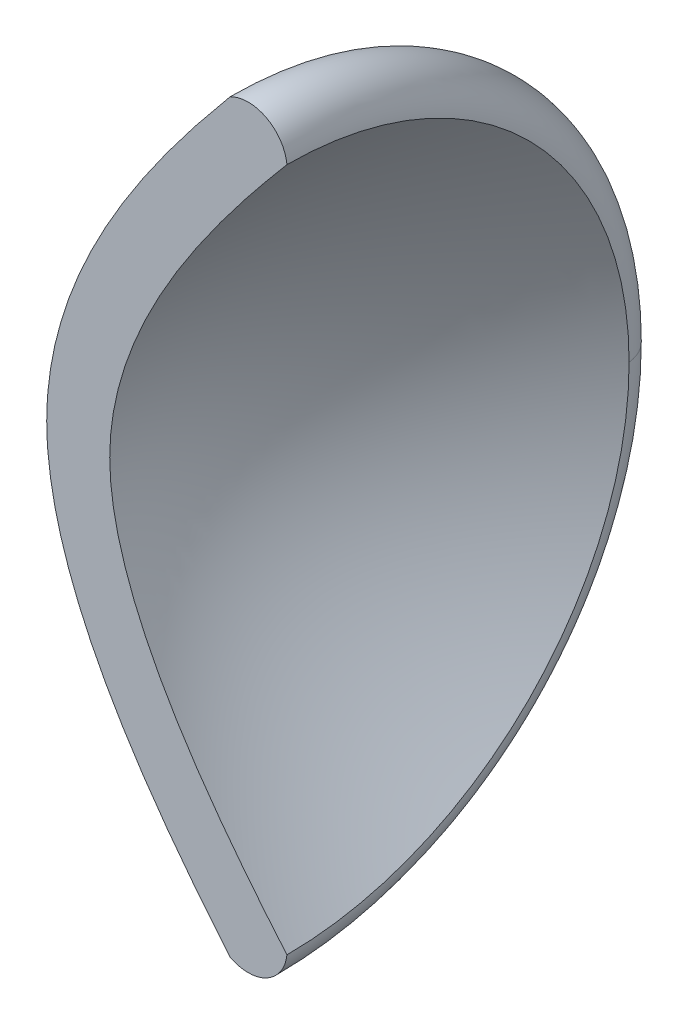
ISO-10303-21;
HEADER;
FILE_DESCRIPTION(('STEP AP214'),'2;1');
FILE_NAME('part.step','',(''),(''),'','','');
FILE_SCHEMA(('AUTOMOTIVE_DESIGN { 1 0 10303 214 1 1 1 1 }'));
ENDSEC;
DATA;
#1=APPLICATION_CONTEXT('core data for automotive mechanical design processes');
#2=APPLICATION_PROTOCOL_DEFINITION('international standard','automotive_design',2000,#1);
#3=PRODUCT_CONTEXT('',#1,'mechanical');
#4=PRODUCT('Part','Part','',(#3));
#5=PRODUCT_RELATED_PRODUCT_CATEGORY('part','',(#4));
#6=PRODUCT_DEFINITION_FORMATION('','',#4);
#7=PRODUCT_DEFINITION_CONTEXT('part definition',#1,'design');
#8=PRODUCT_DEFINITION('design','',#6,#7);
#9=PRODUCT_DEFINITION_SHAPE('','',#8);
#10=(LENGTH_UNIT() NAMED_UNIT(*) SI_UNIT(.MILLI.,.METRE.));
#11=(NAMED_UNIT(*) PLANE_ANGLE_UNIT() SI_UNIT($,.RADIAN.));
#12=(NAMED_UNIT(*) SI_UNIT($,.STERADIAN.) SOLID_ANGLE_UNIT());
#13=UNCERTAINTY_MEASURE_WITH_UNIT(LENGTH_MEASURE(1.E-05),#10,'distance_accuracy_value','');
#14=(GEOMETRIC_REPRESENTATION_CONTEXT(3) GLOBAL_UNCERTAINTY_ASSIGNED_CONTEXT((#13)) GLOBAL_UNIT_ASSIGNED_CONTEXT((#10,
#11,#12)) REPRESENTATION_CONTEXT('',''));
#15=CARTESIAN_POINT('',(0.,0.,0.));
#16=DIRECTION('',(0.,0.,1.));
#17=DIRECTION('',(1.,0.,0.));
#18=AXIS2_PLACEMENT_3D('',#15,#16,#17);
#19=CARTESIAN_POINT('',(0.,0.,0.));
#20=DIRECTION('',(0.,0.,1.));
#21=DIRECTION('',(1.,0.,0.));
#22=AXIS2_PLACEMENT_3D('',#19,#20,#21);
#23=PLANE('',#22);
#24=CARTESIAN_POINT('',(-12.6,0.,0.));
#25=CARTESIAN_POINT('',(-12.6,-0.239686726876587,0.));
#26=CARTESIAN_POINT('',(-12.5532809896166,-0.706763786080965,0.));
#27=CARTESIAN_POINT('',(-12.2813281888698,-1.71271750750897,0.));
#28=CARTESIAN_POINT('',(-11.6295845637007,-3.02560635963737,0.));
#29=CARTESIAN_POINT('',(-10.6663180369142,-4.37323774649369,0.));
#30=CARTESIAN_POINT('',(-10.0228714829141,-5.1533051026573,0.));
#31=CARTESIAN_POINT('',(-9.78735991332297,-5.43051822994852,0.));
#32=(BOUNDED_CURVE() B_SPLINE_CURVE(3,(#24,#25,#26,#27,#28,#29,#30,#31),.UNSPECIFIED.,.F.,
.F.) B_SPLINE_CURVE_WITH_KNOTS((4,1,1,1,1,4),(0.,0.0625,0.125,0.25,0.375,0.446268052906581),
.UNSPECIFIED.) CURVE() GEOMETRIC_REPRESENTATION_ITEM() RATIONAL_B_SPLINE_CURVE((1.,1.,1.,1.,1.,
1.,1.,1.)) REPRESENTATION_ITEM(''));
#33=CARTESIAN_POINT('',(-12.6,0.,0.));
#34=VERTEX_POINT('',#33);
#35=CARTESIAN_POINT('',(-9.78735991332297,-5.43051822994852,0.));
#36=VERTEX_POINT('',#35);
#37=EDGE_CURVE('E61',#34,#36,#32,.T.);
#38=ORIENTED_EDGE('',*,*,#37,.F.);
#39=CARTESIAN_POINT('',(-12.6,0.,0.));
#40=CARTESIAN_POINT('',(-12.6,0.239686726876587,0.));
#41=CARTESIAN_POINT('',(-12.5532809896166,0.706763786080965,0.));
#42=CARTESIAN_POINT('',(-12.2813281888698,1.71271750750897,0.));
#43=CARTESIAN_POINT('',(-11.6295845637007,3.02560635963737,0.));
#44=CARTESIAN_POINT('',(-10.6663180369142,4.37323774649369,0.));
#45=CARTESIAN_POINT('',(-10.0228714829141,5.1533051026573,0.));
#46=CARTESIAN_POINT('',(-9.78735991332297,5.43051822994852,0.));
#47=(BOUNDED_CURVE() B_SPLINE_CURVE(3,(#39,#40,#41,#42,#43,#44,#45,#46),.UNSPECIFIED.,.F.,
.F.) B_SPLINE_CURVE_WITH_KNOTS((4,1,1,1,1,4),(0.,0.0625,0.125,0.25,0.375,0.446268052906581),
.UNSPECIFIED.) CURVE() GEOMETRIC_REPRESENTATION_ITEM() RATIONAL_B_SPLINE_CURVE((1.,1.,1.,1.,1.,
1.,1.,1.)) REPRESENTATION_ITEM(''));
#48=CARTESIAN_POINT('',(-9.78735991332297,5.43051822994852,0.));
#49=VERTEX_POINT('',#48);
#50=EDGE_CURVE('E116',#34,#49,#47,.T.);
#51=ORIENTED_EDGE('',*,*,#50,.T.);
#52=CARTESIAN_POINT('',(-10.4022045497196,5.36534652351512,0.));
#53=DIRECTION('',(0.,0.,1.));
#54=DIRECTION('',(1.,0.,0.));
#55=AXIS2_PLACEMENT_3D('',#52,#53,#54);
#56=CIRCLE('',#55,0.618288992482625);
#57=CARTESIAN_POINT('',(-10.6892488732793,5.9129657658152,0.));
#58=VERTEX_POINT('',#57);
#59=EDGE_CURVE('E105',#58,#49,#56,.F.);
#60=ORIENTED_EDGE('',*,*,#59,.F.);
#61=CARTESIAN_POINT('',(-10.6892488732793,5.9129657658152,0.));
#62=CARTESIAN_POINT('',(-12.1584765663341,4.16112586724597,0.));
#63=CARTESIAN_POINT('',(-13.6,2.07554091366865,0.));
#64=CARTESIAN_POINT('',(-13.6,0.,0.));
#65=(BOUNDED_CURVE() B_SPLINE_CURVE(3,(#61,#62,#63,#64),.UNSPECIFIED.,.F.,
.F.) B_SPLINE_CURVE_WITH_KNOTS((4,4),(0.567533183496852,1.),
.UNSPECIFIED.) CURVE() GEOMETRIC_REPRESENTATION_ITEM() RATIONAL_B_SPLINE_CURVE((1.,1.,1.,1.)) REPRESENTATION_ITEM(''));
#66=CARTESIAN_POINT('',(-13.6,0.,0.));
#67=VERTEX_POINT('',#66);
#68=EDGE_CURVE('E52',#58,#67,#65,.T.);
#69=ORIENTED_EDGE('',*,*,#68,.T.);
#70=CARTESIAN_POINT('',(-10.6892488732793,-5.9129657658152,0.));
#71=CARTESIAN_POINT('',(-12.1584765663341,-4.16112586724597,0.));
#72=CARTESIAN_POINT('',(-13.6,-2.07554091366865,0.));
#73=CARTESIAN_POINT('',(-13.6,0.,0.));
#74=(BOUNDED_CURVE() B_SPLINE_CURVE(3,(#70,#71,#72,#73),.UNSPECIFIED.,.F.,
.F.) B_SPLINE_CURVE_WITH_KNOTS((4,4),(0.567533183496852,1.),
.UNSPECIFIED.) CURVE() GEOMETRIC_REPRESENTATION_ITEM() RATIONAL_B_SPLINE_CURVE((1.,1.,1.,1.)) REPRESENTATION_ITEM(''));
#75=CARTESIAN_POINT('',(-10.6892488732793,-5.9129657658152,0.));
#76=VERTEX_POINT('',#75);
#77=EDGE_CURVE('E11',#76,#67,#74,.T.);
#78=ORIENTED_EDGE('',*,*,#77,.F.);
#79=CARTESIAN_POINT('',(-10.4022045497196,-5.36534652351512,0.));
#80=DIRECTION('',(0.,0.,1.));
#81=DIRECTION('',(1.,0.,0.));
#82=AXIS2_PLACEMENT_3D('',#79,#80,#81);
#83=CIRCLE('',#82,0.618288992482625);
#84=EDGE_CURVE('E73',#36,#76,#83,.F.);
#85=ORIENTED_EDGE('',*,*,#84,.F.);
#86=EDGE_LOOP('',(#38,#51,#60,#69,#78,#85));
#87=FACE_BOUND('',#86,.T.);
#88=ADVANCED_FACE('F46',(#87),#23,.T.);
#89=CARTESIAN_POINT('',(-10.4022045497196,0.,0.));
#90=DIRECTION('',(1.,0.,0.));
#91=DIRECTION('',(0.,0.,-1.));
#92=AXIS2_PLACEMENT_3D('',#89,#90,#91);
#93=TOROIDAL_SURFACE('',#92,5.36534652351512,0.618288992482625);
#94=CARTESIAN_POINT('',(-10.6892488732793,0.,0.));
#95=DIRECTION('',(1.,0.,0.));
#96=DIRECTION('',(0.,0.,1.));
#97=AXIS2_PLACEMENT_3D('',#94,#95,#96);
#98=CIRCLE('',#97,5.9129657658152);
#99=CARTESIAN_POINT('',(-10.6892488732793,0.,-5.9129657658152));
#100=VERTEX_POINT('',#99);
#101=EDGE_CURVE('E133',#100,#58,#98,.T.);
#102=ORIENTED_EDGE('',*,*,#101,.T.);
#103=ORIENTED_EDGE('',*,*,#59,.T.);
#104=CARTESIAN_POINT('',(-9.78735991332297,0.,0.));
#105=DIRECTION('',(-1.,0.,0.));
#106=DIRECTION('',(0.,0.,1.));
#107=AXIS2_PLACEMENT_3D('',#104,#105,#106);
#108=CIRCLE('',#107,5.43051822994852);
#109=CARTESIAN_POINT('',(-9.78735991332297,0.,-5.43051822994852));
#110=VERTEX_POINT('',#109);
#111=EDGE_CURVE('E144',#49,#110,#108,.T.);
#112=ORIENTED_EDGE('',*,*,#111,.T.);
#113=CARTESIAN_POINT('',(-10.4022045497196,0.,-5.36534652351512));
#114=DIRECTION('',(0.,-1.,0.));
#115=DIRECTION('',(0.,0.,-1.));
#116=AXIS2_PLACEMENT_3D('',#113,#114,#115);
#117=CIRCLE('',#116,0.618288992482625);
#118=EDGE_CURVE('E139',#100,#110,#117,.T.);
#119=ORIENTED_EDGE('',*,*,#118,.F.);
#120=EDGE_LOOP('',(#102,#103,#112,#119));
#121=FACE_BOUND('',#120,.T.);
#122=ADVANCED_FACE('F155',(#121),#93,.T.);
#123=CARTESIAN_POINT('',(-10.4022045497196,0.,0.));
#124=DIRECTION('',(1.,0.,0.));
#125=DIRECTION('',(0.,0.,-1.));
#126=AXIS2_PLACEMENT_3D('',#123,#124,#125);
#127=TOROIDAL_SURFACE('',#126,5.36534652351512,0.618288992482625);
#128=CARTESIAN_POINT('',(-9.78735991332297,0.,0.));
#129=DIRECTION('',(-1.,0.,0.));
#130=DIRECTION('',(0.,0.,1.));
#131=AXIS2_PLACEMENT_3D('',#128,#129,#130);
#132=CIRCLE('',#131,5.43051822994852);
#133=EDGE_CURVE('E89',#110,#36,#132,.T.);
#134=ORIENTED_EDGE('',*,*,#133,.T.);
#135=ORIENTED_EDGE('',*,*,#84,.T.);
#136=CARTESIAN_POINT('',(-10.6892488732793,0.,0.));
#137=DIRECTION('',(1.,0.,0.));
#138=DIRECTION('',(0.,0.,1.));
#139=AXIS2_PLACEMENT_3D('',#136,#137,#138);
#140=CIRCLE('',#139,5.9129657658152);
#141=EDGE_CURVE('E111',#76,#100,#140,.T.);
#142=ORIENTED_EDGE('',*,*,#141,.T.);
#143=ORIENTED_EDGE('',*,*,#118,.T.);
#144=EDGE_LOOP('',(#134,#135,#142,#143));
#145=FACE_BOUND('',#144,.T.);
#146=ADVANCED_FACE('F156',(#145),#127,.T.);
#147=CARTESIAN_POINT('',(-10.6892488732794,5.9129657658152,0.));
#148=CARTESIAN_POINT('',(-10.6892488732793,5.91296576581519,-11.8259315316304));
#149=CARTESIAN_POINT('',(-10.6892488732793,-5.91296576581519,-11.8259315316304));
#150=CARTESIAN_POINT('',(-10.6892488732794,-5.9129657658152,0.));
#151=CARTESIAN_POINT('',(-12.1584765663341,4.16112586724597,0.));
#152=CARTESIAN_POINT('',(-12.1584765663341,4.16112586724598,-8.32225173449194));
#153=CARTESIAN_POINT('',(-12.1584765663341,-4.16112586724598,-8.32225173449194));
#154=CARTESIAN_POINT('',(-12.1584765663341,-4.16112586724597,0.));
#155=CARTESIAN_POINT('',(-13.6,2.07554091366866,0.));
#156=CARTESIAN_POINT('',(-13.6,2.07554091366865,-4.15108182733731));
#157=CARTESIAN_POINT('',(-13.6,-2.07554091366865,-4.15108182733731));
#158=CARTESIAN_POINT('',(-13.6,-2.07554091366866,0.));
#159=CARTESIAN_POINT('',(-13.6,0.,0.));
#160=CARTESIAN_POINT('',(-13.6,0.,0.));
#161=CARTESIAN_POINT('',(-13.6,0.,0.));
#162=CARTESIAN_POINT('',(-13.6,0.,0.));
#163=(BOUNDED_SURFACE() B_SPLINE_SURFACE(3,3,((#147,#148,#149,#150),(#151,#152,#153,#154),(#155,
#156,#157,#158),(#159,#160,#161,#162)),.UNSPECIFIED.,.F.,.F.,
.F.) B_SPLINE_SURFACE_WITH_KNOTS((4,4),(4,4),(0.567533183496851,1.),(0.,1.),
.UNSPECIFIED.) GEOMETRIC_REPRESENTATION_ITEM() RATIONAL_B_SPLINE_SURFACE(((1.,0.333333333333334,
0.333333333333334,1.),(1.,0.333333333333334,0.333333333333334,1.),(1.,0.333333333333334,
0.333333333333334,1.),(1.,0.333333333333334,0.333333333333334,1.))) REPRESENTATION_ITEM('') SURFACE());
#164=ORIENTED_EDGE('',*,*,#141,.F.);
#165=ORIENTED_EDGE('',*,*,#77,.T.);
#166=ORIENTED_EDGE('',*,*,#68,.F.);
#167=ORIENTED_EDGE('',*,*,#101,.F.);
#168=EDGE_LOOP('',(#164,#165,#166,#167));
#169=FACE_BOUND('',#168,.T.);
#170=ADVANCED_FACE('F48',(#169),#163,.F.);
#171=CARTESIAN_POINT('',(-12.6,0.,0.));
#172=CARTESIAN_POINT('',(-12.6,0.,0.));
#173=CARTESIAN_POINT('',(-12.6,0.,0.));
#174=CARTESIAN_POINT('',(-12.6,0.,0.));
#175=CARTESIAN_POINT('',(-12.6,0.239686726876587,0.));
#176=CARTESIAN_POINT('',(-12.6,0.239686726876587,-0.479373453753174));
#177=CARTESIAN_POINT('',(-12.6,-0.239686726876587,-0.479373453753174));
#178=CARTESIAN_POINT('',(-12.6,-0.239686726876587,0.));
#179=CARTESIAN_POINT('',(-12.5532809896166,0.706763786080965,0.));
#180=CARTESIAN_POINT('',(-12.5532809896166,0.706763786080965,-1.41352757216193));
#181=CARTESIAN_POINT('',(-12.5532809896166,-0.706763786080965,-1.41352757216193));
#182=CARTESIAN_POINT('',(-12.5532809896166,-0.706763786080965,0.));
#183=CARTESIAN_POINT('',(-12.2813281888698,1.71271750750897,0.));
#184=CARTESIAN_POINT('',(-12.2813281888699,1.71271750750896,-3.42543501501792));
#185=CARTESIAN_POINT('',(-12.2813281888699,-1.71271750750896,-3.42543501501792));
#186=CARTESIAN_POINT('',(-12.2813281888698,-1.71271750750897,0.));
#187=CARTESIAN_POINT('',(-11.6295845637007,3.02560635963737,0.));
#188=CARTESIAN_POINT('',(-11.6295845637007,3.02560635963737,-6.05121271927474));
#189=CARTESIAN_POINT('',(-11.6295845637007,-3.02560635963737,-6.05121271927474));
#190=CARTESIAN_POINT('',(-11.6295845637007,-3.02560635963737,0.));
#191=CARTESIAN_POINT('',(-10.6663180369126,4.37323774649603,0.));
#192=CARTESIAN_POINT('',(-10.6663180369126,4.37323774649603,-8.74647549299206));
#193=CARTESIAN_POINT('',(-10.6663180369126,-4.37323774649602,-8.74647549299206));
#194=CARTESIAN_POINT('',(-10.6663180369126,-4.37323774649603,0.));
#195=CARTESIAN_POINT('',(-10.0228714829105,5.15330510266173,0.));
#196=CARTESIAN_POINT('',(-10.0228714829105,5.15330510266173,-10.3066102053235));
#197=CARTESIAN_POINT('',(-10.0228714829105,-5.15330510266173,-10.3066102053235));
#198=CARTESIAN_POINT('',(-10.0228714829105,-5.15330510266173,0.));
#199=CARTESIAN_POINT('',(-9.78735991332297,5.43051822994852,0.));
#200=CARTESIAN_POINT('',(-9.78735991332296,5.43051822994852,-10.861036459897));
#201=CARTESIAN_POINT('',(-9.78735991332296,-5.43051822994852,-10.861036459897));
#202=CARTESIAN_POINT('',(-9.78735991332297,-5.43051822994852,0.));
#203=(BOUNDED_SURFACE() B_SPLINE_SURFACE(3,3,((#171,#172,#173,#174),(#175,#176,#177,#178),(#179,
#180,#181,#182),(#183,#184,#185,#186),(#187,#188,#189,#190),(#191,#192,#193,#194),(#195,#196,
#197,#198),(#199,#200,#201,#202)),.UNSPECIFIED.,.F.,.F.,.F.) B_SPLINE_SURFACE_WITH_KNOTS((4,1,1,
1,1,4),(4,4),(0.,0.0625,0.125,0.25,0.375,0.446268052907139),(0.,1.),
.UNSPECIFIED.) GEOMETRIC_REPRESENTATION_ITEM() RATIONAL_B_SPLINE_SURFACE(((1.,0.333333333333334,
0.333333333333334,1.),(1.,0.333333333333334,0.333333333333334,1.),(1.,0.333333333333334,
0.333333333333334,1.),(1.,0.333333333333334,0.333333333333334,1.),(1.,0.333333333333334,
0.333333333333334,1.),(1.,0.333333333333334,0.333333333333334,1.),(1.,0.333333333333334,
0.333333333333334,1.),(1.,0.333333333333334,0.333333333333334,1.))) REPRESENTATION_ITEM('') SURFACE());
#204=ORIENTED_EDGE('',*,*,#50,.F.);
#205=ORIENTED_EDGE('',*,*,#37,.T.);
#206=ORIENTED_EDGE('',*,*,#133,.F.);
#207=ORIENTED_EDGE('',*,*,#111,.F.);
#208=EDGE_LOOP('',(#204,#205,#206,#207));
#209=FACE_BOUND('',#208,.T.);
#210=ADVANCED_FACE('F165',(#209),#203,.F.);
#211=CLOSED_SHELL('',(#88,#122,#146,#170,#210));
#212=MANIFOLD_SOLID_BREP('B2',#211);
#213=ADVANCED_BREP_SHAPE_REPRESENTATION('',(#18,#212),#14);
#214=SHAPE_DEFINITION_REPRESENTATION(#9,#213);
ENDSEC;
END-ISO-10303-21;
